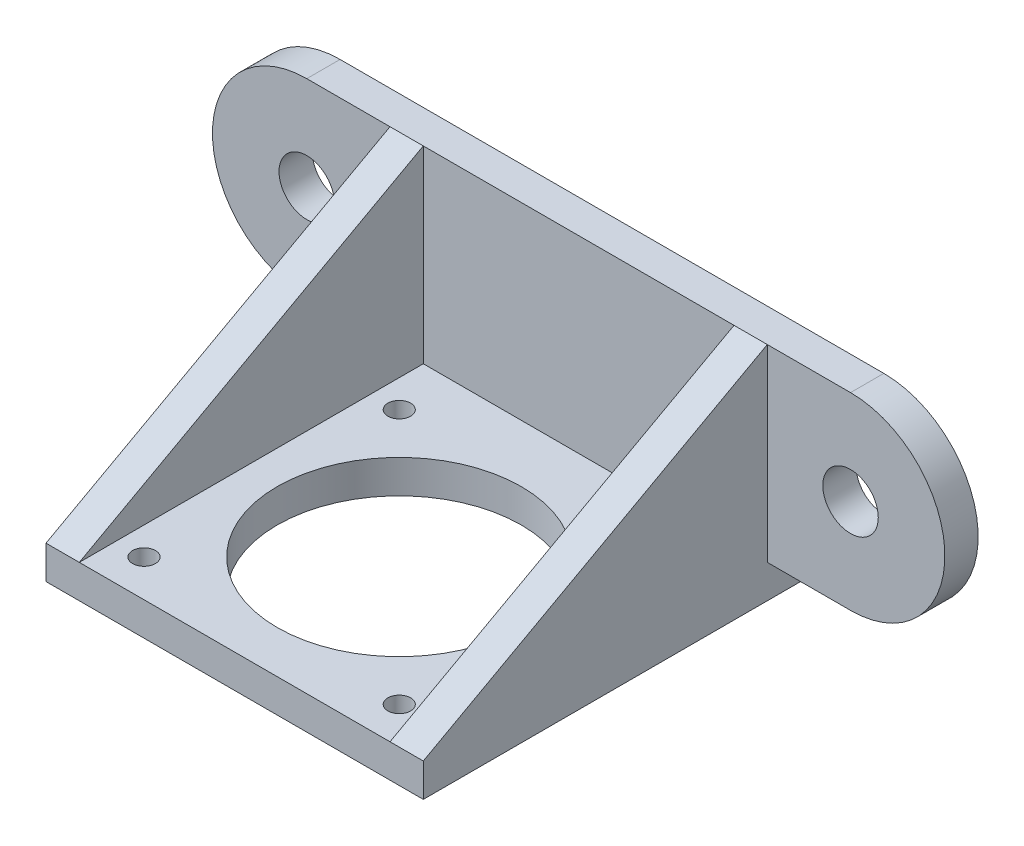
ISO-10303-21;
HEADER;
FILE_DESCRIPTION(('STEP AP214'),'2;1');
FILE_NAME('part.step','',(''),(''),'','','');
FILE_SCHEMA(('AUTOMOTIVE_DESIGN { 1 0 10303 214 1 1 1 1 }'));
ENDSEC;
DATA;
#1=APPLICATION_CONTEXT('core data for automotive mechanical design processes');
#2=APPLICATION_PROTOCOL_DEFINITION('international standard','automotive_design',2000,#1);
#3=PRODUCT_CONTEXT('',#1,'mechanical');
#4=PRODUCT('Part','Part','',(#3));
#5=PRODUCT_RELATED_PRODUCT_CATEGORY('part','',(#4));
#6=PRODUCT_DEFINITION_FORMATION('','',#4);
#7=PRODUCT_DEFINITION_CONTEXT('part definition',#1,'design');
#8=PRODUCT_DEFINITION('design','',#6,#7);
#9=PRODUCT_DEFINITION_SHAPE('','',#8);
#10=(LENGTH_UNIT() NAMED_UNIT(*) SI_UNIT(.MILLI.,.METRE.));
#11=(NAMED_UNIT(*) PLANE_ANGLE_UNIT() SI_UNIT($,.RADIAN.));
#12=(NAMED_UNIT(*) SI_UNIT($,.STERADIAN.) SOLID_ANGLE_UNIT());
#13=UNCERTAINTY_MEASURE_WITH_UNIT(LENGTH_MEASURE(1.E-05),#10,'distance_accuracy_value','');
#14=(GEOMETRIC_REPRESENTATION_CONTEXT(3) GLOBAL_UNCERTAINTY_ASSIGNED_CONTEXT((#13)) GLOBAL_UNIT_ASSIGNED_CONTEXT((#10,
#11,#12)) REPRESENTATION_CONTEXT('',''));
#15=CARTESIAN_POINT('',(0.,0.,0.));
#16=DIRECTION('',(0.,0.,1.));
#17=DIRECTION('',(1.,0.,0.));
#18=AXIS2_PLACEMENT_3D('',#15,#16,#17);
#19=CARTESIAN_POINT('',(-17.,0.,0.));
#20=DIRECTION('',(-1.,0.,0.));
#21=DIRECTION('',(0.,0.,1.));
#22=AXIS2_PLACEMENT_3D('',#19,#20,#21);
#23=PLANE('',#22);
#24=DIRECTION('',(0.,0.480832611206852,-0.876812408671319));
#25=VECTOR('',#24,1.);
#26=CARTESIAN_POINT('',(-17.,3.,34.));
#27=LINE('',#26,#25);
#28=CARTESIAN_POINT('',(-17.,3.,34.));
#29=VERTEX_POINT('',#28);
#30=CARTESIAN_POINT('',(-17.,20.,3.));
#31=VERTEX_POINT('',#30);
#32=EDGE_CURVE('E180',#29,#31,#27,.T.);
#33=ORIENTED_EDGE('',*,*,#32,.T.);
#34=DIRECTION('',(0.,-1.,0.));
#35=VECTOR('',#34,1.);
#36=CARTESIAN_POINT('',(-17.,3.,3.));
#37=LINE('',#36,#35);
#38=CARTESIAN_POINT('',(-17.,3.,3.));
#39=VERTEX_POINT('',#38);
#40=EDGE_CURVE('E155',#31,#39,#37,.T.);
#41=ORIENTED_EDGE('',*,*,#40,.T.);
#42=DIRECTION('',(0.,0.,-1.));
#43=VECTOR('',#42,1.);
#44=CARTESIAN_POINT('',(-17.,3.,3.));
#45=LINE('',#44,#43);
#46=CARTESIAN_POINT('',(-17.,3.,0.));
#47=VERTEX_POINT('',#46);
#48=EDGE_CURVE('E284',#39,#47,#45,.T.);
#49=ORIENTED_EDGE('',*,*,#48,.T.);
#50=DIRECTION('',(0.,1.,0.));
#51=VECTOR('',#50,1.);
#52=CARTESIAN_POINT('',(-17.,0.,0.));
#53=LINE('',#52,#51);
#54=CARTESIAN_POINT('',(-17.,0.,0.));
#55=VERTEX_POINT('',#54);
#56=EDGE_CURVE('E250',#55,#47,#53,.T.);
#57=ORIENTED_EDGE('',*,*,#56,.F.);
#58=DIRECTION('',(0.,0.,-1.));
#59=VECTOR('',#58,1.);
#60=CARTESIAN_POINT('',(-17.,0.,0.));
#61=LINE('',#60,#59);
#62=CARTESIAN_POINT('',(-17.,0.,34.));
#63=VERTEX_POINT('',#62);
#64=EDGE_CURVE('E239',#63,#55,#61,.T.);
#65=ORIENTED_EDGE('',*,*,#64,.F.);
#66=DIRECTION('',(0.,-1.,0.));
#67=VECTOR('',#66,1.);
#68=CARTESIAN_POINT('',(-17.,0.,34.));
#69=LINE('',#68,#67);
#70=EDGE_CURVE('E189',#29,#63,#69,.T.);
#71=ORIENTED_EDGE('',*,*,#70,.F.);
#72=EDGE_LOOP('',(#33,#41,#49,#57,#65,#71));
#73=FACE_BOUND('',#72,.T.);
#74=ADVANCED_FACE('F58',(#73),#23,.T.);
#75=CARTESIAN_POINT('',(17.,3.,3.));
#76=DIRECTION('',(0.,0.,-1.));
#77=DIRECTION('',(-1.,0.,0.));
#78=AXIS2_PLACEMENT_3D('',#75,#76,#77);
#79=PLANE('',#78);
#80=DIRECTION('',(0.,1.,0.));
#81=VECTOR('',#80,1.);
#82=CARTESIAN_POINT('',(-14.,3.,3.));
#83=LINE('',#82,#81);
#84=CARTESIAN_POINT('',(-14.,3.,3.));
#85=VERTEX_POINT('',#84);
#86=CARTESIAN_POINT('',(-14.,20.,3.));
#87=VERTEX_POINT('',#86);
#88=EDGE_CURVE('E81',#85,#87,#83,.T.);
#89=ORIENTED_EDGE('',*,*,#88,.F.);
#90=DIRECTION('',(-1.,0.,0.));
#91=VECTOR('',#90,1.);
#92=CARTESIAN_POINT('',(17.,3.,3.));
#93=LINE('',#92,#91);
#94=CARTESIAN_POINT('',(14.,3.,3.));
#95=VERTEX_POINT('',#94);
#96=EDGE_CURVE('E259',#95,#85,#93,.T.);
#97=ORIENTED_EDGE('',*,*,#96,.F.);
#98=DIRECTION('',(0.,-1.,0.));
#99=VECTOR('',#98,1.);
#100=CARTESIAN_POINT('',(14.,3.,3.));
#101=LINE('',#100,#99);
#102=CARTESIAN_POINT('',(14.,20.,3.));
#103=VERTEX_POINT('',#102);
#104=EDGE_CURVE('E237',#103,#95,#101,.T.);
#105=ORIENTED_EDGE('',*,*,#104,.F.);
#106=DIRECTION('',(-1.,0.,0.));
#107=VECTOR('',#106,1.);
#108=CARTESIAN_POINT('',(17.,20.,3.));
#109=LINE('',#108,#107);
#110=EDGE_CURVE('E261',#103,#87,#109,.T.);
#111=ORIENTED_EDGE('',*,*,#110,.T.);
#112=EDGE_LOOP('',(#89,#97,#105,#111));
#113=FACE_BOUND('',#112,.T.);
#114=ADVANCED_FACE('F326',(#113),#79,.F.);
#115=CARTESIAN_POINT('',(17.,3.,3.));
#116=DIRECTION('',(0.,-1.,0.));
#117=DIRECTION('',(0.,0.,-1.));
#118=AXIS2_PLACEMENT_3D('',#115,#116,#117);
#119=PLANE('',#118);
#120=CARTESIAN_POINT('',(11.5,3.,30.6680107417615));
#121=DIRECTION('',(0.,1.,0.));
#122=DIRECTION('',(0.,0.,1.));
#123=AXIS2_PLACEMENT_3D('',#120,#121,#122);
#124=CIRCLE('',#123,1.025);
#125=CARTESIAN_POINT('',(11.5,3.,31.6930107417615));
#126=VERTEX_POINT('',#125);
#127=EDGE_CURVE('E300',#126,#126,#124,.T.);
#128=ORIENTED_EDGE('',*,*,#127,.F.);
#129=EDGE_LOOP('',(#128));
#130=FACE_BOUND('',#129,.T.);
#131=CARTESIAN_POINT('',(11.5,3.,7.66801074176154));
#132=DIRECTION('',(0.,1.,0.));
#133=DIRECTION('',(0.,0.,1.));
#134=AXIS2_PLACEMENT_3D('',#131,#132,#133);
#135=CIRCLE('',#134,1.025);
#136=CARTESIAN_POINT('',(11.5,3.,8.69301074176154));
#137=VERTEX_POINT('',#136);
#138=EDGE_CURVE('E299',#137,#137,#135,.T.);
#139=ORIENTED_EDGE('',*,*,#138,.F.);
#140=EDGE_LOOP('',(#139));
#141=FACE_BOUND('',#140,.T.);
#142=CARTESIAN_POINT('',(-11.5,3.,30.6680107417615));
#143=DIRECTION('',(0.,1.,0.));
#144=DIRECTION('',(0.,0.,1.));
#145=AXIS2_PLACEMENT_3D('',#142,#143,#144);
#146=CIRCLE('',#145,1.025);
#147=CARTESIAN_POINT('',(-11.5,3.,31.6930107417615));
#148=VERTEX_POINT('',#147);
#149=EDGE_CURVE('E306',#148,#148,#146,.T.);
#150=ORIENTED_EDGE('',*,*,#149,.F.);
#151=EDGE_LOOP('',(#150));
#152=FACE_BOUND('',#151,.T.);
#153=CARTESIAN_POINT('',(-11.5,3.,7.66801074176154));
#154=DIRECTION('',(0.,1.,0.));
#155=DIRECTION('',(0.,0.,1.));
#156=AXIS2_PLACEMENT_3D('',#153,#154,#155);
#157=CIRCLE('',#156,1.025);
#158=CARTESIAN_POINT('',(-11.5,3.,8.69301074176154));
#159=VERTEX_POINT('',#158);
#160=EDGE_CURVE('E312',#159,#159,#157,.T.);
#161=ORIENTED_EDGE('',*,*,#160,.F.);
#162=EDGE_LOOP('',(#161));
#163=FACE_BOUND('',#162,.T.);
#164=CARTESIAN_POINT('',(0.,3.,19.1680107417615));
#165=DIRECTION('',(0.,1.,0.));
#166=DIRECTION('',(0.,0.,1.));
#167=AXIS2_PLACEMENT_3D('',#164,#165,#166);
#168=CIRCLE('',#167,11.);
#169=CARTESIAN_POINT('',(0.,3.,30.1680107417615));
#170=VERTEX_POINT('',#169);
#171=EDGE_CURVE('E292',#170,#170,#168,.T.);
#172=ORIENTED_EDGE('',*,*,#171,.F.);
#173=EDGE_LOOP('',(#172));
#174=FACE_BOUND('',#173,.T.);
#175=DIRECTION('',(0.,0.,-1.));
#176=VECTOR('',#175,1.);
#177=CARTESIAN_POINT('',(-14.,3.,3.));
#178=LINE('',#177,#176);
#179=CARTESIAN_POINT('',(-14.,3.,34.));
#180=VERTEX_POINT('',#179);
#181=EDGE_CURVE('E183',#180,#85,#178,.T.);
#182=ORIENTED_EDGE('',*,*,#181,.F.);
#183=DIRECTION('',(-1.,0.,0.));
#184=VECTOR('',#183,1.);
#185=CARTESIAN_POINT('',(17.,3.,34.));
#186=LINE('',#185,#184);
#187=CARTESIAN_POINT('',(14.,3.,34.));
#188=VERTEX_POINT('',#187);
#189=EDGE_CURVE('E255',#188,#180,#186,.T.);
#190=ORIENTED_EDGE('',*,*,#189,.F.);
#191=DIRECTION('',(0.,0.,1.));
#192=VECTOR('',#191,1.);
#193=CARTESIAN_POINT('',(14.,3.,3.));
#194=LINE('',#193,#192);
#195=EDGE_CURVE('E233',#95,#188,#194,.T.);
#196=ORIENTED_EDGE('',*,*,#195,.F.);
#197=ORIENTED_EDGE('',*,*,#96,.T.);
#198=EDGE_LOOP('',(#182,#190,#196,#197));
#199=FACE_BOUND('',#198,.T.);
#200=ADVANCED_FACE('F322',(#130,#141,#152,#163,#174,#199),#119,.F.);
#201=CARTESIAN_POINT('',(17.,0.,0.));
#202=DIRECTION('',(-1.,0.,0.));
#203=DIRECTION('',(0.,0.,1.));
#204=AXIS2_PLACEMENT_3D('',#201,#202,#203);
#205=PLANE('',#204);
#206=DIRECTION('',(0.,0.,-1.));
#207=VECTOR('',#206,1.);
#208=CARTESIAN_POINT('',(17.,3.,3.));
#209=LINE('',#208,#207);
#210=CARTESIAN_POINT('',(17.,3.,3.));
#211=VERTEX_POINT('',#210);
#212=CARTESIAN_POINT('',(17.,3.,0.));
#213=VERTEX_POINT('',#212);
#214=EDGE_CURVE('E226',#211,#213,#209,.T.);
#215=ORIENTED_EDGE('',*,*,#214,.F.);
#216=DIRECTION('',(0.,-1.,0.));
#217=VECTOR('',#216,1.);
#218=CARTESIAN_POINT('',(17.,3.,3.));
#219=LINE('',#218,#217);
#220=CARTESIAN_POINT('',(17.,20.,3.00000000000002));
#221=VERTEX_POINT('',#220);
#222=EDGE_CURVE('E206',#221,#211,#219,.T.);
#223=ORIENTED_EDGE('',*,*,#222,.F.);
#224=DIRECTION('',(0.,0.480832611206852,-0.876812408671319));
#225=VECTOR('',#224,1.);
#226=CARTESIAN_POINT('',(17.,3.,34.));
#227=LINE('',#226,#225);
#228=CARTESIAN_POINT('',(17.,3.,34.));
#229=VERTEX_POINT('',#228);
#230=EDGE_CURVE('E230',#229,#221,#227,.T.);
#231=ORIENTED_EDGE('',*,*,#230,.F.);
#232=DIRECTION('',(0.,-1.,0.));
#233=VECTOR('',#232,1.);
#234=CARTESIAN_POINT('',(17.,0.,34.));
#235=LINE('',#234,#233);
#236=CARTESIAN_POINT('',(17.,0.,34.));
#237=VERTEX_POINT('',#236);
#238=EDGE_CURVE('E245',#229,#237,#235,.T.);
#239=ORIENTED_EDGE('',*,*,#238,.T.);
#240=DIRECTION('',(0.,0.,-1.));
#241=VECTOR('',#240,1.);
#242=CARTESIAN_POINT('',(17.,0.,0.));
#243=LINE('',#242,#241);
#244=CARTESIAN_POINT('',(17.,0.,0.));
#245=VERTEX_POINT('',#244);
#246=EDGE_CURVE('E240',#237,#245,#243,.T.);
#247=ORIENTED_EDGE('',*,*,#246,.T.);
#248=DIRECTION('',(0.,1.,0.));
#249=VECTOR('',#248,1.);
#250=CARTESIAN_POINT('',(17.,0.,0.));
#251=LINE('',#250,#249);
#252=EDGE_CURVE('E243',#245,#213,#251,.T.);
#253=ORIENTED_EDGE('',*,*,#252,.T.);
#254=EDGE_LOOP('',(#215,#223,#231,#239,#247,#253));
#255=FACE_BOUND('',#254,.T.);
#256=ADVANCED_FACE('F325',(#255),#205,.F.);
#257=CARTESIAN_POINT('',(17.,0.,0.));
#258=DIRECTION('',(0.,1.,0.));
#259=DIRECTION('',(0.,0.,1.));
#260=AXIS2_PLACEMENT_3D('',#257,#258,#259);
#261=PLANE('',#260);
#262=CARTESIAN_POINT('',(11.5,0.,30.6680107417615));
#263=DIRECTION('',(0.,1.,0.));
#264=DIRECTION('',(0.,0.,1.));
#265=AXIS2_PLACEMENT_3D('',#262,#263,#264);
#266=CIRCLE('',#265,1.025);
#267=CARTESIAN_POINT('',(11.5,0.,31.6930107417615));
#268=VERTEX_POINT('',#267);
#269=EDGE_CURVE('E296',#268,#268,#266,.F.);
#270=ORIENTED_EDGE('',*,*,#269,.F.);
#271=EDGE_LOOP('',(#270));
#272=FACE_BOUND('',#271,.T.);
#273=CARTESIAN_POINT('',(11.5,0.,7.66801074176154));
#274=DIRECTION('',(0.,1.,0.));
#275=DIRECTION('',(0.,0.,1.));
#276=AXIS2_PLACEMENT_3D('',#273,#274,#275);
#277=CIRCLE('',#276,1.025);
#278=CARTESIAN_POINT('',(11.5,0.,8.69301074176154));
#279=VERTEX_POINT('',#278);
#280=EDGE_CURVE('E303',#279,#279,#277,.F.);
#281=ORIENTED_EDGE('',*,*,#280,.F.);
#282=EDGE_LOOP('',(#281));
#283=FACE_BOUND('',#282,.T.);
#284=CARTESIAN_POINT('',(-11.5,0.,30.6680107417615));
#285=DIRECTION('',(0.,1.,0.));
#286=DIRECTION('',(0.,0.,1.));
#287=AXIS2_PLACEMENT_3D('',#284,#285,#286);
#288=CIRCLE('',#287,1.025);
#289=CARTESIAN_POINT('',(-11.5,0.,31.6930107417615));
#290=VERTEX_POINT('',#289);
#291=EDGE_CURVE('E309',#290,#290,#288,.F.);
#292=ORIENTED_EDGE('',*,*,#291,.F.);
#293=EDGE_LOOP('',(#292));
#294=FACE_BOUND('',#293,.T.);
#295=CARTESIAN_POINT('',(-11.5,0.,7.66801074176154));
#296=DIRECTION('',(0.,1.,0.));
#297=DIRECTION('',(0.,0.,1.));
#298=AXIS2_PLACEMENT_3D('',#295,#296,#297);
#299=CIRCLE('',#298,1.025);
#300=CARTESIAN_POINT('',(-11.5,0.,8.69301074176154));
#301=VERTEX_POINT('',#300);
#302=EDGE_CURVE('E295',#301,#301,#299,.F.);
#303=ORIENTED_EDGE('',*,*,#302,.F.);
#304=EDGE_LOOP('',(#303));
#305=FACE_BOUND('',#304,.T.);
#306=CARTESIAN_POINT('',(0.,0.,19.1680107417615));
#307=DIRECTION('',(0.,1.,0.));
#308=DIRECTION('',(0.,0.,1.));
#309=AXIS2_PLACEMENT_3D('',#306,#307,#308);
#310=CIRCLE('',#309,11.);
#311=CARTESIAN_POINT('',(0.,0.,30.1680107417615));
#312=VERTEX_POINT('',#311);
#313=EDGE_CURVE('E288',#312,#312,#310,.F.);
#314=ORIENTED_EDGE('',*,*,#313,.F.);
#315=EDGE_LOOP('',(#314));
#316=FACE_BOUND('',#315,.T.);
#317=ORIENTED_EDGE('',*,*,#64,.T.);
#318=DIRECTION('',(-1.,0.,0.));
#319=VECTOR('',#318,1.);
#320=CARTESIAN_POINT('',(17.,0.,0.));
#321=LINE('',#320,#319);
#322=EDGE_CURVE('E12',#245,#55,#321,.T.);
#323=ORIENTED_EDGE('',*,*,#322,.F.);
#324=ORIENTED_EDGE('',*,*,#246,.F.);
#325=DIRECTION('',(-1.,0.,0.));
#326=VECTOR('',#325,1.);
#327=CARTESIAN_POINT('',(17.,0.,34.));
#328=LINE('',#327,#326);
#329=EDGE_CURVE('E247',#237,#63,#328,.T.);
#330=ORIENTED_EDGE('',*,*,#329,.T.);
#331=EDGE_LOOP('',(#317,#323,#324,#330));
#332=FACE_BOUND('',#331,.T.);
#333=ADVANCED_FACE('F60',(#272,#283,#294,#305,#316,#332),#261,.F.);
#334=CARTESIAN_POINT('',(17.,0.,0.));
#335=DIRECTION('',(0.,0.,1.));
#336=DIRECTION('',(1.,0.,0.));
#337=AXIS2_PLACEMENT_3D('',#334,#335,#336);
#338=PLANE('',#337);
#339=ORIENTED_EDGE('',*,*,#56,.T.);
#340=DIRECTION('',(-1.,0.,0.));
#341=VECTOR('',#340,1.);
#342=CARTESIAN_POINT('',(-17.,3.,0.));
#343=LINE('',#342,#341);
#344=CARTESIAN_POINT('',(-24.5,3.,0.));
#345=VERTEX_POINT('',#344);
#346=EDGE_CURVE('E73',#47,#345,#343,.T.);
#347=ORIENTED_EDGE('',*,*,#346,.T.);
#348=CARTESIAN_POINT('',(-24.5,11.5,0.));
#349=DIRECTION('',(0.,0.,-1.));
#350=DIRECTION('',(1.,0.,0.));
#351=AXIS2_PLACEMENT_3D('',#348,#349,#350);
#352=CIRCLE('',#351,8.5);
#353=CARTESIAN_POINT('',(-24.5,20.,0.));
#354=VERTEX_POINT('',#353);
#355=EDGE_CURVE('E271',#345,#354,#352,.T.);
#356=ORIENTED_EDGE('',*,*,#355,.T.);
#357=DIRECTION('',(-1.,0.,0.));
#358=VECTOR('',#357,1.);
#359=CARTESIAN_POINT('',(17.,20.,0.));
#360=LINE('',#359,#358);
#361=CARTESIAN_POINT('',(24.5,20.,0.));
#362=VERTEX_POINT('',#361);
#363=EDGE_CURVE('E66',#362,#354,#360,.T.);
#364=ORIENTED_EDGE('',*,*,#363,.F.);
#365=CARTESIAN_POINT('',(24.5,11.5,0.));
#366=DIRECTION('',(0.,0.,1.));
#367=DIRECTION('',(-1.,0.,0.));
#368=AXIS2_PLACEMENT_3D('',#365,#366,#367);
#369=CIRCLE('',#368,8.5);
#370=CARTESIAN_POINT('',(24.5,3.,0.));
#371=VERTEX_POINT('',#370);
#372=EDGE_CURVE('E210',#371,#362,#369,.T.);
#373=ORIENTED_EDGE('',*,*,#372,.F.);
#374=DIRECTION('',(1.,0.,0.));
#375=VECTOR('',#374,1.);
#376=CARTESIAN_POINT('',(17.,3.,0.));
#377=LINE('',#376,#375);
#378=EDGE_CURVE('E203',#213,#371,#377,.T.);
#379=ORIENTED_EDGE('',*,*,#378,.F.);
#380=ORIENTED_EDGE('',*,*,#252,.F.);
#381=ORIENTED_EDGE('',*,*,#322,.T.);
#382=EDGE_LOOP('',(#339,#347,#356,#364,#373,#379,#380,#381));
#383=FACE_BOUND('',#382,.T.);
#384=CARTESIAN_POINT('',(24.5,11.5,0.));
#385=DIRECTION('',(0.,0.,1.));
#386=DIRECTION('',(1.,0.,0.));
#387=AXIS2_PLACEMENT_3D('',#384,#385,#386);
#388=CIRCLE('',#387,2.5);
#389=CARTESIAN_POINT('',(27.,11.5,0.));
#390=VERTEX_POINT('',#389);
#391=EDGE_CURVE('E199',#390,#390,#388,.T.);
#392=ORIENTED_EDGE('',*,*,#391,.T.);
#393=EDGE_LOOP('',(#392));
#394=FACE_BOUND('',#393,.T.);
#395=CARTESIAN_POINT('',(-24.5,11.5,0.));
#396=DIRECTION('',(0.,0.,-1.));
#397=DIRECTION('',(-1.,0.,0.));
#398=AXIS2_PLACEMENT_3D('',#395,#396,#397);
#399=CIRCLE('',#398,2.5);
#400=CARTESIAN_POINT('',(-27.,11.5,0.));
#401=VERTEX_POINT('',#400);
#402=EDGE_CURVE('E279',#401,#401,#399,.T.);
#403=ORIENTED_EDGE('',*,*,#402,.F.);
#404=EDGE_LOOP('',(#403));
#405=FACE_BOUND('',#404,.T.);
#406=ADVANCED_FACE('F273',(#383,#394,#405),#338,.F.);
#407=CARTESIAN_POINT('',(17.,20.,0.));
#408=DIRECTION('',(0.,-1.,0.));
#409=DIRECTION('',(0.,0.,-1.));
#410=AXIS2_PLACEMENT_3D('',#407,#408,#409);
#411=PLANE('',#410);
#412=DIRECTION('',(-1.,0.,0.));
#413=VECTOR('',#412,1.);
#414=CARTESIAN_POINT('',(17.,20.,3.));
#415=LINE('',#414,#413);
#416=EDGE_CURVE('E170',#87,#31,#415,.T.);
#417=ORIENTED_EDGE('',*,*,#416,.F.);
#418=ORIENTED_EDGE('',*,*,#110,.F.);
#419=EDGE_CURVE('E262',#221,#103,#109,.T.);
#420=ORIENTED_EDGE('',*,*,#419,.F.);
#421=DIRECTION('',(-1.,0.,0.));
#422=VECTOR('',#421,1.);
#423=CARTESIAN_POINT('',(17.,20.,3.));
#424=LINE('',#423,#422);
#425=CARTESIAN_POINT('',(24.5,20.,3.));
#426=VERTEX_POINT('',#425);
#427=EDGE_CURVE('E214',#426,#221,#424,.T.);
#428=ORIENTED_EDGE('',*,*,#427,.F.);
#429=DIRECTION('',(0.,0.,-1.));
#430=VECTOR('',#429,1.);
#431=CARTESIAN_POINT('',(24.5,20.,3.));
#432=LINE('',#431,#430);
#433=EDGE_CURVE('E217',#426,#362,#432,.T.);
#434=ORIENTED_EDGE('',*,*,#433,.T.);
#435=ORIENTED_EDGE('',*,*,#363,.T.);
#436=DIRECTION('',(0.,0.,-1.));
#437=VECTOR('',#436,1.);
#438=CARTESIAN_POINT('',(-24.5,20.,3.));
#439=LINE('',#438,#437);
#440=CARTESIAN_POINT('',(-24.5,20.,3.));
#441=VERTEX_POINT('',#440);
#442=EDGE_CURVE('E172',#441,#354,#439,.T.);
#443=ORIENTED_EDGE('',*,*,#442,.F.);
#444=DIRECTION('',(1.,0.,0.));
#445=VECTOR('',#444,1.);
#446=CARTESIAN_POINT('',(-17.,20.,3.));
#447=LINE('',#446,#445);
#448=EDGE_CURVE('E159',#441,#31,#447,.T.);
#449=ORIENTED_EDGE('',*,*,#448,.T.);
#450=EDGE_LOOP('',(#417,#418,#420,#428,#434,#435,#443,#449));
#451=FACE_BOUND('',#450,.T.);
#452=ADVANCED_FACE('F168',(#451),#411,.F.);
#453=CARTESIAN_POINT('',(17.,0.,34.));
#454=DIRECTION('',(0.,0.,-1.));
#455=DIRECTION('',(-1.,0.,0.));
#456=AXIS2_PLACEMENT_3D('',#453,#454,#455);
#457=PLANE('',#456);
#458=ORIENTED_EDGE('',*,*,#70,.T.);
#459=ORIENTED_EDGE('',*,*,#329,.F.);
#460=ORIENTED_EDGE('',*,*,#238,.F.);
#461=EDGE_CURVE('E256',#229,#188,#186,.T.);
#462=ORIENTED_EDGE('',*,*,#461,.T.);
#463=ORIENTED_EDGE('',*,*,#189,.T.);
#464=DIRECTION('',(1.,0.,0.));
#465=VECTOR('',#464,1.);
#466=CARTESIAN_POINT('',(17.,3.,34.));
#467=LINE('',#466,#465);
#468=EDGE_CURVE('E184',#29,#180,#467,.T.);
#469=ORIENTED_EDGE('',*,*,#468,.F.);
#470=EDGE_LOOP('',(#458,#459,#460,#462,#463,#469));
#471=FACE_BOUND('',#470,.T.);
#472=ADVANCED_FACE('F336',(#471),#457,.F.);
#473=CARTESIAN_POINT('',(14.,10.,17.));
#474=DIRECTION('',(1.,0.,0.));
#475=DIRECTION('',(0.,0.,-1.));
#476=AXIS2_PLACEMENT_3D('',#473,#474,#475);
#477=PLANE('',#476);
#478=DIRECTION('',(0.,0.480832611206852,-0.876812408671319));
#479=VECTOR('',#478,1.);
#480=CARTESIAN_POINT('',(14.,3.,34.));
#481=LINE('',#480,#479);
#482=EDGE_CURVE('E229',#188,#103,#481,.T.);
#483=ORIENTED_EDGE('',*,*,#482,.T.);
#484=ORIENTED_EDGE('',*,*,#104,.T.);
#485=ORIENTED_EDGE('',*,*,#195,.T.);
#486=EDGE_LOOP('',(#483,#484,#485));
#487=FACE_BOUND('',#486,.T.);
#488=ADVANCED_FACE('F362',(#487),#477,.F.);
#489=CARTESIAN_POINT('',(17.,3.,34.));
#490=DIRECTION('',(0.,-0.876812408671319,-0.480832611206852));
#491=DIRECTION('',(0.,0.480832611206852,-0.876812408671319));
#492=AXIS2_PLACEMENT_3D('',#489,#490,#491);
#493=PLANE('',#492);
#494=ORIENTED_EDGE('',*,*,#419,.T.);
#495=ORIENTED_EDGE('',*,*,#482,.F.);
#496=ORIENTED_EDGE('',*,*,#461,.F.);
#497=ORIENTED_EDGE('',*,*,#230,.T.);
#498=EDGE_LOOP('',(#494,#495,#496,#497));
#499=FACE_BOUND('',#498,.T.);
#500=ADVANCED_FACE('F392',(#499),#493,.F.);
#501=CARTESIAN_POINT('',(24.5,11.5,3.));
#502=DIRECTION('',(0.,0.,-1.));
#503=DIRECTION('',(-1.,0.,0.));
#504=AXIS2_PLACEMENT_3D('',#501,#502,#503);
#505=PLANE('',#504);
#506=ORIENTED_EDGE('',*,*,#222,.T.);
#507=DIRECTION('',(1.,0.,0.));
#508=VECTOR('',#507,1.);
#509=CARTESIAN_POINT('',(17.,3.,3.));
#510=LINE('',#509,#508);
#511=CARTESIAN_POINT('',(24.5,3.,3.));
#512=VERTEX_POINT('',#511);
#513=EDGE_CURVE('E209',#211,#512,#510,.T.);
#514=ORIENTED_EDGE('',*,*,#513,.T.);
#515=CARTESIAN_POINT('',(24.5,11.5,3.));
#516=DIRECTION('',(0.,0.,1.));
#517=DIRECTION('',(-1.,0.,0.));
#518=AXIS2_PLACEMENT_3D('',#515,#516,#517);
#519=CIRCLE('',#518,8.5);
#520=EDGE_CURVE('E212',#512,#426,#519,.T.);
#521=ORIENTED_EDGE('',*,*,#520,.T.);
#522=ORIENTED_EDGE('',*,*,#427,.T.);
#523=EDGE_LOOP('',(#506,#514,#521,#522));
#524=FACE_BOUND('',#523,.T.);
#525=CARTESIAN_POINT('',(24.5,11.5,3.));
#526=DIRECTION('',(0.,0.,1.));
#527=DIRECTION('',(1.,0.,0.));
#528=AXIS2_PLACEMENT_3D('',#525,#526,#527);
#529=CIRCLE('',#528,2.5);
#530=CARTESIAN_POINT('',(27.,11.5,3.));
#531=VERTEX_POINT('',#530);
#532=EDGE_CURVE('E200',#531,#531,#529,.T.);
#533=ORIENTED_EDGE('',*,*,#532,.F.);
#534=EDGE_LOOP('',(#533));
#535=FACE_BOUND('',#534,.T.);
#536=ADVANCED_FACE('F396',(#524,#535),#505,.F.);
#537=CARTESIAN_POINT('',(17.,3.,3.));
#538=DIRECTION('',(0.,1.,0.));
#539=DIRECTION('',(0.,0.,1.));
#540=AXIS2_PLACEMENT_3D('',#537,#538,#539);
#541=PLANE('',#540);
#542=ORIENTED_EDGE('',*,*,#378,.T.);
#543=DIRECTION('',(0.,0.,-1.));
#544=VECTOR('',#543,1.);
#545=CARTESIAN_POINT('',(24.5,3.,3.));
#546=LINE('',#545,#544);
#547=EDGE_CURVE('E223',#512,#371,#546,.T.);
#548=ORIENTED_EDGE('',*,*,#547,.F.);
#549=ORIENTED_EDGE('',*,*,#513,.F.);
#550=ORIENTED_EDGE('',*,*,#214,.T.);
#551=EDGE_LOOP('',(#542,#548,#549,#550));
#552=FACE_BOUND('',#551,.T.);
#553=ADVANCED_FACE('F403',(#552),#541,.F.);
#554=CARTESIAN_POINT('',(24.5,11.5,3.));
#555=DIRECTION('',(0.,0.,-1.));
#556=DIRECTION('',(-1.,0.,0.));
#557=AXIS2_PLACEMENT_3D('',#554,#555,#556);
#558=CYLINDRICAL_SURFACE('',#557,8.5);
#559=ORIENTED_EDGE('',*,*,#372,.T.);
#560=ORIENTED_EDGE('',*,*,#433,.F.);
#561=ORIENTED_EDGE('',*,*,#520,.F.);
#562=ORIENTED_EDGE('',*,*,#547,.T.);
#563=EDGE_LOOP('',(#559,#560,#561,#562));
#564=FACE_BOUND('',#563,.T.);
#565=ADVANCED_FACE('F348',(#564),#558,.T.);
#566=CARTESIAN_POINT('',(24.5,11.5,3.));
#567=DIRECTION('',(0.,0.,-1.));
#568=DIRECTION('',(-1.,0.,0.));
#569=AXIS2_PLACEMENT_3D('',#566,#567,#568);
#570=CYLINDRICAL_SURFACE('',#569,2.5);
#571=ORIENTED_EDGE('',*,*,#532,.T.);
#572=EDGE_LOOP('',(#571));
#573=FACE_BOUND('',#572,.T.);
#574=ORIENTED_EDGE('',*,*,#391,.F.);
#575=EDGE_LOOP('',(#574));
#576=FACE_BOUND('',#575,.T.);
#577=ADVANCED_FACE('F341',(#573,#576),#570,.F.);
#578=CARTESIAN_POINT('',(-14.,10.,17.));
#579=DIRECTION('',(-1.,0.,0.));
#580=DIRECTION('',(0.,0.,1.));
#581=AXIS2_PLACEMENT_3D('',#578,#579,#580);
#582=PLANE('',#581);
#583=ORIENTED_EDGE('',*,*,#181,.T.);
#584=ORIENTED_EDGE('',*,*,#88,.T.);
#585=DIRECTION('',(0.,0.480832611206852,-0.876812408671319));
#586=VECTOR('',#585,1.);
#587=CARTESIAN_POINT('',(-14.,3.,34.));
#588=LINE('',#587,#586);
#589=EDGE_CURVE('E182',#180,#87,#588,.T.);
#590=ORIENTED_EDGE('',*,*,#589,.F.);
#591=EDGE_LOOP('',(#583,#584,#590));
#592=FACE_BOUND('',#591,.T.);
#593=ADVANCED_FACE('F339',(#592),#582,.F.);
#594=CARTESIAN_POINT('',(-17.,3.,34.));
#595=DIRECTION('',(0.,0.876812408671319,0.480832611206852));
#596=DIRECTION('',(0.,0.480832611206852,-0.876812408671319));
#597=AXIS2_PLACEMENT_3D('',#594,#595,#596);
#598=PLANE('',#597);
#599=ORIENTED_EDGE('',*,*,#589,.T.);
#600=ORIENTED_EDGE('',*,*,#416,.T.);
#601=ORIENTED_EDGE('',*,*,#32,.F.);
#602=ORIENTED_EDGE('',*,*,#468,.T.);
#603=EDGE_LOOP('',(#599,#600,#601,#602));
#604=FACE_BOUND('',#603,.T.);
#605=ADVANCED_FACE('F178',(#604),#598,.T.);
#606=CARTESIAN_POINT('',(-24.5,11.5,3.));
#607=DIRECTION('',(0.,0.,-1.));
#608=DIRECTION('',(-1.,0.,0.));
#609=AXIS2_PLACEMENT_3D('',#606,#607,#608);
#610=CYLINDRICAL_SURFACE('',#609,8.5);
#611=ORIENTED_EDGE('',*,*,#355,.F.);
#612=DIRECTION('',(0.,0.,-1.));
#613=VECTOR('',#612,1.);
#614=CARTESIAN_POINT('',(-24.5,3.,3.));
#615=LINE('',#614,#613);
#616=CARTESIAN_POINT('',(-24.5,3.,3.));
#617=VERTEX_POINT('',#616);
#618=EDGE_CURVE('E272',#617,#345,#615,.T.);
#619=ORIENTED_EDGE('',*,*,#618,.F.);
#620=CARTESIAN_POINT('',(-24.5,11.5,3.));
#621=DIRECTION('',(0.,0.,-1.));
#622=DIRECTION('',(1.,0.,0.));
#623=AXIS2_PLACEMENT_3D('',#620,#621,#622);
#624=CIRCLE('',#623,8.5);
#625=EDGE_CURVE('E173',#617,#441,#624,.T.);
#626=ORIENTED_EDGE('',*,*,#625,.T.);
#627=ORIENTED_EDGE('',*,*,#442,.T.);
#628=EDGE_LOOP('',(#611,#619,#626,#627));
#629=FACE_BOUND('',#628,.T.);
#630=ADVANCED_FACE('F270',(#629),#610,.T.);
#631=CARTESIAN_POINT('',(-17.,3.,3.));
#632=DIRECTION('',(0.,-1.,0.));
#633=DIRECTION('',(0.,0.,-1.));
#634=AXIS2_PLACEMENT_3D('',#631,#632,#633);
#635=PLANE('',#634);
#636=ORIENTED_EDGE('',*,*,#346,.F.);
#637=ORIENTED_EDGE('',*,*,#48,.F.);
#638=DIRECTION('',(-1.,0.,0.));
#639=VECTOR('',#638,1.);
#640=CARTESIAN_POINT('',(-17.,3.,3.));
#641=LINE('',#640,#639);
#642=EDGE_CURVE('E162',#39,#617,#641,.T.);
#643=ORIENTED_EDGE('',*,*,#642,.T.);
#644=ORIENTED_EDGE('',*,*,#618,.T.);
#645=EDGE_LOOP('',(#636,#637,#643,#644));
#646=FACE_BOUND('',#645,.T.);
#647=ADVANCED_FACE('F285',(#646),#635,.T.);
#648=CARTESIAN_POINT('',(-24.5,11.5,3.));
#649=DIRECTION('',(0.,0.,-1.));
#650=DIRECTION('',(1.,0.,0.));
#651=AXIS2_PLACEMENT_3D('',#648,#649,#650);
#652=PLANE('',#651);
#653=CARTESIAN_POINT('',(-24.5,11.5,3.));
#654=DIRECTION('',(0.,0.,-1.));
#655=DIRECTION('',(-1.,0.,0.));
#656=AXIS2_PLACEMENT_3D('',#653,#654,#655);
#657=CIRCLE('',#656,2.5);
#658=CARTESIAN_POINT('',(-27.,11.5,3.));
#659=VERTEX_POINT('',#658);
#660=EDGE_CURVE('E275',#659,#659,#657,.T.);
#661=ORIENTED_EDGE('',*,*,#660,.T.);
#662=EDGE_LOOP('',(#661));
#663=FACE_BOUND('',#662,.T.);
#664=ORIENTED_EDGE('',*,*,#40,.F.);
#665=ORIENTED_EDGE('',*,*,#448,.F.);
#666=ORIENTED_EDGE('',*,*,#625,.F.);
#667=ORIENTED_EDGE('',*,*,#642,.F.);
#668=EDGE_LOOP('',(#664,#665,#666,#667));
#669=FACE_BOUND('',#668,.T.);
#670=ADVANCED_FACE('F157',(#663,#669),#652,.F.);
#671=CARTESIAN_POINT('',(-24.5,11.5,3.));
#672=DIRECTION('',(0.,0.,-1.));
#673=DIRECTION('',(-1.,0.,0.));
#674=AXIS2_PLACEMENT_3D('',#671,#672,#673);
#675=CYLINDRICAL_SURFACE('',#674,2.5);
#676=ORIENTED_EDGE('',*,*,#660,.F.);
#677=EDGE_LOOP('',(#676));
#678=FACE_BOUND('',#677,.T.);
#679=ORIENTED_EDGE('',*,*,#402,.T.);
#680=EDGE_LOOP('',(#679));
#681=FACE_BOUND('',#680,.T.);
#682=ADVANCED_FACE('F506',(#678,#681),#675,.F.);
#683=CARTESIAN_POINT('',(0.,-31.1126983722081,19.1680107417615));
#684=DIRECTION('',(0.,1.,0.));
#685=DIRECTION('',(0.,0.,1.));
#686=AXIS2_PLACEMENT_3D('',#683,#684,#685);
#687=CYLINDRICAL_SURFACE('',#686,11.);
#688=ORIENTED_EDGE('',*,*,#313,.T.);
#689=EDGE_LOOP('',(#688));
#690=FACE_BOUND('',#689,.T.);
#691=ORIENTED_EDGE('',*,*,#171,.T.);
#692=EDGE_LOOP('',(#691));
#693=FACE_BOUND('',#692,.T.);
#694=ADVANCED_FACE('F516',(#690,#693),#687,.F.);
#695=CARTESIAN_POINT('',(-11.5,-31.1126983722081,7.66801074176154));
#696=DIRECTION('',(0.,1.,0.));
#697=DIRECTION('',(0.,0.,1.));
#698=AXIS2_PLACEMENT_3D('',#695,#696,#697);
#699=CYLINDRICAL_SURFACE('',#698,1.025);
#700=ORIENTED_EDGE('',*,*,#302,.T.);
#701=EDGE_LOOP('',(#700));
#702=FACE_BOUND('',#701,.T.);
#703=ORIENTED_EDGE('',*,*,#160,.T.);
#704=EDGE_LOOP('',(#703));
#705=FACE_BOUND('',#704,.T.);
#706=ADVANCED_FACE('F320',(#702,#705),#699,.F.);
#707=CARTESIAN_POINT('',(-11.5,-31.1126983722081,30.6680107417615));
#708=DIRECTION('',(0.,1.,0.));
#709=DIRECTION('',(0.,0.,1.));
#710=AXIS2_PLACEMENT_3D('',#707,#708,#709);
#711=CYLINDRICAL_SURFACE('',#710,1.025);
#712=ORIENTED_EDGE('',*,*,#291,.T.);
#713=EDGE_LOOP('',(#712));
#714=FACE_BOUND('',#713,.T.);
#715=ORIENTED_EDGE('',*,*,#149,.T.);
#716=EDGE_LOOP('',(#715));
#717=FACE_BOUND('',#716,.T.);
#718=ADVANCED_FACE('F547',(#714,#717),#711,.F.);
#719=CARTESIAN_POINT('',(11.5,-31.1126983722081,7.66801074176154));
#720=DIRECTION('',(0.,1.,0.));
#721=DIRECTION('',(0.,0.,1.));
#722=AXIS2_PLACEMENT_3D('',#719,#720,#721);
#723=CYLINDRICAL_SURFACE('',#722,1.025);
#724=ORIENTED_EDGE('',*,*,#280,.T.);
#725=EDGE_LOOP('',(#724));
#726=FACE_BOUND('',#725,.T.);
#727=ORIENTED_EDGE('',*,*,#138,.T.);
#728=EDGE_LOOP('',(#727));
#729=FACE_BOUND('',#728,.T.);
#730=ADVANCED_FACE('F558',(#726,#729),#723,.F.);
#731=CARTESIAN_POINT('',(11.5,-31.1126983722081,30.6680107417615));
#732=DIRECTION('',(0.,1.,0.));
#733=DIRECTION('',(0.,0.,1.));
#734=AXIS2_PLACEMENT_3D('',#731,#732,#733);
#735=CYLINDRICAL_SURFACE('',#734,1.025);
#736=ORIENTED_EDGE('',*,*,#269,.T.);
#737=EDGE_LOOP('',(#736));
#738=FACE_BOUND('',#737,.T.);
#739=ORIENTED_EDGE('',*,*,#127,.T.);
#740=EDGE_LOOP('',(#739));
#741=FACE_BOUND('',#740,.T.);
#742=ADVANCED_FACE('F569',(#738,#741),#735,.F.);
#743=CLOSED_SHELL('',(#74,#114,#200,#256,#333,#406,#452,#472,#488,#500,#536,#553,#565,#577,#593,
#605,#630,#647,#670,#682,#694,#706,#718,#730,#742));
#744=MANIFOLD_SOLID_BREP('B2',#743);
#745=ADVANCED_BREP_SHAPE_REPRESENTATION('',(#18,#744),#14);
#746=SHAPE_DEFINITION_REPRESENTATION(#9,#745);
ENDSEC;
END-ISO-10303-21;
